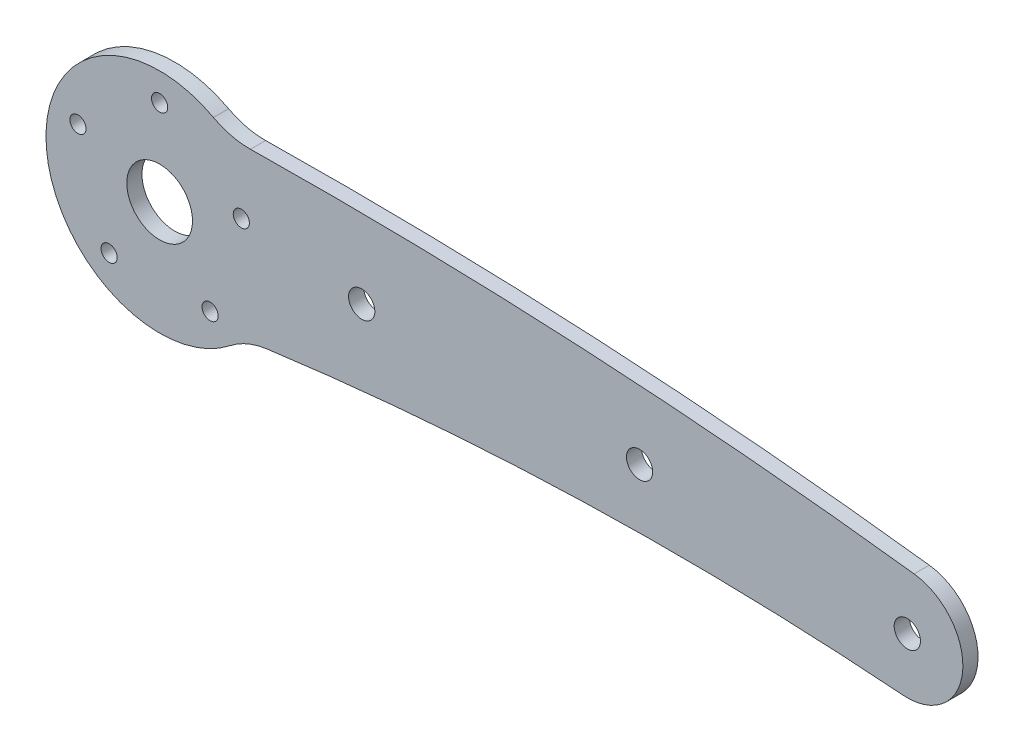
ISO-10303-21;
HEADER;
FILE_DESCRIPTION(('STEP AP214'),'2;1');
FILE_NAME('part.step','',(''),(''),'','','');
FILE_SCHEMA(('AUTOMOTIVE_DESIGN { 1 0 10303 214 1 1 1 1 }'));
ENDSEC;
DATA;
#1=APPLICATION_CONTEXT('core data for automotive mechanical design processes');
#2=APPLICATION_PROTOCOL_DEFINITION('international standard','automotive_design',2000,#1);
#3=PRODUCT_CONTEXT('',#1,'mechanical');
#4=PRODUCT('Part','Part','',(#3));
#5=PRODUCT_RELATED_PRODUCT_CATEGORY('part','',(#4));
#6=PRODUCT_DEFINITION_FORMATION('','',#4);
#7=PRODUCT_DEFINITION_CONTEXT('part definition',#1,'design');
#8=PRODUCT_DEFINITION('design','',#6,#7);
#9=PRODUCT_DEFINITION_SHAPE('','',#8);
#10=(LENGTH_UNIT() NAMED_UNIT(*) SI_UNIT(.MILLI.,.METRE.));
#11=(NAMED_UNIT(*) PLANE_ANGLE_UNIT() SI_UNIT($,.RADIAN.));
#12=(NAMED_UNIT(*) SI_UNIT($,.STERADIAN.) SOLID_ANGLE_UNIT());
#13=UNCERTAINTY_MEASURE_WITH_UNIT(LENGTH_MEASURE(1.E-05),#10,'distance_accuracy_value','');
#14=(GEOMETRIC_REPRESENTATION_CONTEXT(3) GLOBAL_UNCERTAINTY_ASSIGNED_CONTEXT((#13)) GLOBAL_UNIT_ASSIGNED_CONTEXT((#10,
#11,#12)) REPRESENTATION_CONTEXT('',''));
#15=CARTESIAN_POINT('',(0.,0.,0.));
#16=DIRECTION('',(0.,0.,1.));
#17=DIRECTION('',(1.,0.,0.));
#18=AXIS2_PLACEMENT_3D('',#15,#16,#17);
#19=CARTESIAN_POINT('',(16.2151699746623,-465.930427659477,0.));
#20=DIRECTION('',(0.,0.,1.));
#21=DIRECTION('',(1.,0.,0.));
#22=AXIS2_PLACEMENT_3D('',#19,#20,#21);
#23=PLANE('',#22);
#24=CARTESIAN_POINT('',(148.,0.,0.));
#25=DIRECTION('',(0.,0.,1.));
#26=DIRECTION('',(1.,0.,0.));
#27=AXIS2_PLACEMENT_3D('',#24,#25,#26);
#28=CIRCLE('',#27,2.59999999999999);
#29=CARTESIAN_POINT('',(150.6,0.,0.));
#30=VERTEX_POINT('',#29);
#31=EDGE_CURVE('E148',#30,#30,#28,.T.);
#32=ORIENTED_EDGE('',*,*,#31,.T.);
#33=EDGE_LOOP('',(#32));
#34=FACE_BOUND('',#33,.T.);
#35=CARTESIAN_POINT('',(95.,2.5,0.));
#36=DIRECTION('',(0.,0.,1.));
#37=DIRECTION('',(1.,0.,0.));
#38=AXIS2_PLACEMENT_3D('',#35,#36,#37);
#39=CIRCLE('',#38,2.6);
#40=CARTESIAN_POINT('',(97.6,2.5,0.));
#41=VERTEX_POINT('',#40);
#42=EDGE_CURVE('E152',#41,#41,#39,.T.);
#43=ORIENTED_EDGE('',*,*,#42,.T.);
#44=EDGE_LOOP('',(#43));
#45=FACE_BOUND('',#44,.T.);
#46=CARTESIAN_POINT('',(40.,2.5,0.));
#47=DIRECTION('',(0.,0.,1.));
#48=DIRECTION('',(1.,0.,0.));
#49=AXIS2_PLACEMENT_3D('',#46,#47,#48);
#50=CIRCLE('',#49,2.6);
#51=CARTESIAN_POINT('',(42.6,2.5,0.));
#52=VERTEX_POINT('',#51);
#53=EDGE_CURVE('E149',#52,#52,#50,.T.);
#54=ORIENTED_EDGE('',*,*,#53,.T.);
#55=EDGE_LOOP('',(#54));
#56=FACE_BOUND('',#55,.T.);
#57=CARTESIAN_POINT('',(0.,0.,0.));
#58=DIRECTION('',(0.,0.,1.));
#59=DIRECTION('',(1.,0.,0.));
#60=AXIS2_PLACEMENT_3D('',#57,#58,#59);
#61=CIRCLE('',#60,6.5);
#62=CARTESIAN_POINT('',(6.5,0.,0.));
#63=VERTEX_POINT('',#62);
#64=EDGE_CURVE('E138',#63,#63,#61,.T.);
#65=ORIENTED_EDGE('',*,*,#64,.T.);
#66=EDGE_LOOP('',(#65));
#67=FACE_BOUND('',#66,.T.);
#68=CARTESIAN_POINT('',(16.1679607770181,5.25328890437479,0.));
#69=DIRECTION('',(0.,0.,1.));
#70=DIRECTION('',(1.,0.,0.));
#71=AXIS2_PLACEMENT_3D('',#68,#69,#70);
#72=CIRCLE('',#71,1.60000000000033);
#73=CARTESIAN_POINT('',(17.7679607770184,5.25328890437479,0.));
#74=VERTEX_POINT('',#73);
#75=EDGE_CURVE('E133',#74,#74,#72,.T.);
#76=ORIENTED_EDGE('',*,*,#75,.T.);
#77=EDGE_LOOP('',(#76));
#78=FACE_BOUND('',#77,.T.);
#79=CARTESIAN_POINT('',(9.99234928897335,-13.7532889043737,0.));
#80=DIRECTION('',(0.,0.,1.));
#81=DIRECTION('',(1.,0.,0.));
#82=AXIS2_PLACEMENT_3D('',#79,#80,#81);
#83=CIRCLE('',#82,1.60000000000122);
#84=CARTESIAN_POINT('',(11.5923492889746,-13.7532889043737,0.));
#85=VERTEX_POINT('',#84);
#86=EDGE_CURVE('E141',#85,#85,#83,.T.);
#87=ORIENTED_EDGE('',*,*,#86,.T.);
#88=EDGE_LOOP('',(#87));
#89=FACE_BOUND('',#88,.T.);
#90=CARTESIAN_POINT('',(-9.99234928897074,-13.7532889043745,0.));
#91=DIRECTION('',(0.,0.,1.));
#92=DIRECTION('',(1.,0.,0.));
#93=AXIS2_PLACEMENT_3D('',#90,#91,#92);
#94=CIRCLE('',#93,1.60000000000151);
#95=CARTESIAN_POINT('',(-8.39234928896922,-13.7532889043745,0.));
#96=VERTEX_POINT('',#95);
#97=EDGE_CURVE('E137',#96,#96,#94,.T.);
#98=ORIENTED_EDGE('',*,*,#97,.T.);
#99=EDGE_LOOP('',(#98));
#100=FACE_BOUND('',#99,.T.);
#101=CARTESIAN_POINT('',(-16.1679607770171,5.25328890437342,0.));
#102=DIRECTION('',(0.,0.,1.));
#103=DIRECTION('',(1.,0.,0.));
#104=AXIS2_PLACEMENT_3D('',#101,#102,#103);
#105=CIRCLE('',#104,1.60000000000086);
#106=CARTESIAN_POINT('',(-14.5679607770163,5.25328890437342,0.));
#107=VERTEX_POINT('',#106);
#108=EDGE_CURVE('E134',#107,#107,#105,.T.);
#109=ORIENTED_EDGE('',*,*,#108,.T.);
#110=EDGE_LOOP('',(#109));
#111=FACE_BOUND('',#110,.T.);
#112=CARTESIAN_POINT('',(0.,17.,0.));
#113=DIRECTION('',(0.,0.,1.));
#114=DIRECTION('',(1.,0.,0.));
#115=AXIS2_PLACEMENT_3D('',#112,#113,#114);
#116=CIRCLE('',#115,1.6);
#117=CARTESIAN_POINT('',(1.6,17.,0.));
#118=VERTEX_POINT('',#117);
#119=EDGE_CURVE('E130',#118,#118,#116,.T.);
#120=ORIENTED_EDGE('',*,*,#119,.T.);
#121=EDGE_LOOP('',(#120));
#122=FACE_BOUND('',#121,.T.);
#123=CARTESIAN_POINT('',(101.290137246622,-609.211940724704,0.));
#124=DIRECTION('',(0.,0.,-1.));
#125=DIRECTION('',(-1.,0.,0.));
#126=AXIS2_PLACEMENT_3D('',#123,#124,#125);
#127=CIRCLE('',#126,600.);
#128=CARTESIAN_POINT('',(147.159069573998,-10.9678090801501,0.));
#129=VERTEX_POINT('',#128);
#130=CARTESIAN_POINT('',(21.2206318411808,-14.5785458467105,0.));
#131=VERTEX_POINT('',#130);
#132=EDGE_CURVE('E118',#129,#131,#127,.F.);
#133=ORIENTED_EDGE('',*,*,#132,.T.);
#134=CARTESIAN_POINT('',(23.2223694763168,-29.4443807186603,0.));
#135=DIRECTION('',(0.,0.,1.));
#136=DIRECTION('',(1.,0.,0.));
#137=AXIS2_PLACEMENT_3D('',#134,#135,#136);
#138=CIRCLE('',#137,15.);
#139=CARTESIAN_POINT('',(13.9334216857902,-17.6666284311963,0.));
#140=VERTEX_POINT('',#139);
#141=EDGE_CURVE('E11',#131,#140,#138,.T.);
#142=ORIENTED_EDGE('',*,*,#141,.T.);
#143=CARTESIAN_POINT('',(0.,0.,0.));
#144=DIRECTION('',(0.,0.,1.));
#145=DIRECTION('',(1.,0.,0.));
#146=AXIS2_PLACEMENT_3D('',#143,#144,#145);
#147=CIRCLE('',#146,22.5);
#148=CARTESIAN_POINT('',(10.6561368325306,19.8165776007459,0.));
#149=VERTEX_POINT('',#148);
#150=EDGE_CURVE('E119',#149,#140,#147,.T.);
#151=ORIENTED_EDGE('',*,*,#150,.F.);
#152=CARTESIAN_POINT('',(17.7602280542176,33.0276293345766,0.));
#153=DIRECTION('',(0.,0.,1.));
#154=DIRECTION('',(1.,0.,0.));
#155=AXIS2_PLACEMENT_3D('',#152,#153,#154);
#156=CIRCLE('',#155,15.);
#157=CARTESIAN_POINT('',(17.9882608816027,18.0293627337444,0.));
#158=VERTEX_POINT('',#157);
#159=EDGE_CURVE('E46',#149,#158,#156,.T.);
#160=ORIENTED_EDGE('',*,*,#159,.T.);
#161=CARTESIAN_POINT('',(32.4303399493245,-931.860855318953,0.));
#162=DIRECTION('',(0.,0.,-1.));
#163=DIRECTION('',(-1.,0.,0.));
#164=AXIS2_PLACEMENT_3D('',#161,#162,#163);
#165=CIRCLE('',#164,950.);
#166=CARTESIAN_POINT('',(149.353851182702,10.9163678471869,0.));
#167=VERTEX_POINT('',#166);
#168=EDGE_CURVE('E115',#167,#158,#165,.F.);
#169=ORIENTED_EDGE('',*,*,#168,.F.);
#170=CARTESIAN_POINT('',(148.,0.,0.));
#171=DIRECTION('',(0.,0.,-1.));
#172=DIRECTION('',(-1.,0.,0.));
#173=AXIS2_PLACEMENT_3D('',#170,#171,#172);
#174=CIRCLE('',#173,10.9999999999999);
#175=EDGE_CURVE('E121',#129,#167,#174,.F.);
#176=ORIENTED_EDGE('',*,*,#175,.F.);
#177=EDGE_LOOP('',(#133,#142,#151,#160,#169,#176));
#178=FACE_BOUND('',#177,.T.);
#179=ADVANCED_FACE('F37',(#34,#45,#56,#67,#78,#89,#100,#111,#122,#178),#23,.F.);
#180=CARTESIAN_POINT('',(32.4303399493245,-931.860855318953,5.));
#181=DIRECTION('',(0.,0.,-1.));
#182=DIRECTION('',(-1.,0.,0.));
#183=AXIS2_PLACEMENT_3D('',#180,#181,#182);
#184=CYLINDRICAL_SURFACE('',#183,950.);
#185=CARTESIAN_POINT('',(32.4303399493245,-931.860855318953,3.));
#186=DIRECTION('',(0.,0.,-1.));
#187=DIRECTION('',(-1.,0.,0.));
#188=AXIS2_PLACEMENT_3D('',#185,#186,#187);
#189=CIRCLE('',#188,950.);
#190=CARTESIAN_POINT('',(149.353851182702,10.9163678471868,3.));
#191=VERTEX_POINT('',#190);
#192=CARTESIAN_POINT('',(17.9882608816027,18.0293627337445,3.));
#193=VERTEX_POINT('',#192);
#194=EDGE_CURVE('E172',#191,#193,#189,.F.);
#195=ORIENTED_EDGE('',*,*,#194,.F.);
#196=DIRECTION('',(0.,0.,-1.));
#197=VECTOR('',#196,1.);
#198=CARTESIAN_POINT('',(149.353851182702,10.9163678471868,5.));
#199=LINE('',#198,#197);
#200=EDGE_CURVE('E124',#167,#191,#199,.F.);
#201=ORIENTED_EDGE('',*,*,#200,.F.);
#202=ORIENTED_EDGE('',*,*,#168,.T.);
#203=DIRECTION('',(0.,0.,-1.));
#204=VECTOR('',#203,1.);
#205=CARTESIAN_POINT('',(17.9882608816027,18.0293627337446,5.));
#206=LINE('',#205,#204);
#207=EDGE_CURVE('E105',#158,#193,#206,.F.);
#208=ORIENTED_EDGE('',*,*,#207,.T.);
#209=EDGE_LOOP('',(#195,#201,#202,#208));
#210=FACE_BOUND('',#209,.T.);
#211=ADVANCED_FACE('F210',(#210),#184,.T.);
#212=CARTESIAN_POINT('',(101.290137246622,-609.211940724704,5.));
#213=DIRECTION('',(0.,0.,-1.));
#214=DIRECTION('',(-1.,0.,0.));
#215=AXIS2_PLACEMENT_3D('',#212,#213,#214);
#216=CYLINDRICAL_SURFACE('',#215,600.);
#217=DIRECTION('',(0.,0.,-1.));
#218=VECTOR('',#217,1.);
#219=CARTESIAN_POINT('',(147.159069573998,-10.9678090801501,5.));
#220=LINE('',#219,#218);
#221=CARTESIAN_POINT('',(147.159069573998,-10.9678090801502,3.));
#222=VERTEX_POINT('',#221);
#223=EDGE_CURVE('E101',#222,#129,#220,.T.);
#224=ORIENTED_EDGE('',*,*,#223,.F.);
#225=CARTESIAN_POINT('',(101.290137246622,-609.211940724704,3.));
#226=DIRECTION('',(0.,0.,-1.));
#227=DIRECTION('',(-1.,0.,0.));
#228=AXIS2_PLACEMENT_3D('',#225,#226,#227);
#229=CIRCLE('',#228,600.);
#230=CARTESIAN_POINT('',(21.2206318411808,-14.5785458467105,3.));
#231=VERTEX_POINT('',#230);
#232=EDGE_CURVE('E92',#222,#231,#229,.F.);
#233=ORIENTED_EDGE('',*,*,#232,.T.);
#234=DIRECTION('',(0.,0.,-1.));
#235=VECTOR('',#234,1.);
#236=CARTESIAN_POINT('',(21.2206318411808,-14.5785458467105,5.));
#237=LINE('',#236,#235);
#238=EDGE_CURVE('E61',#231,#131,#237,.T.);
#239=ORIENTED_EDGE('',*,*,#238,.T.);
#240=ORIENTED_EDGE('',*,*,#132,.F.);
#241=EDGE_LOOP('',(#224,#233,#239,#240));
#242=FACE_BOUND('',#241,.T.);
#243=ADVANCED_FACE('F100',(#242),#216,.F.);
#244=CARTESIAN_POINT('',(148.,0.,5.));
#245=DIRECTION('',(0.,0.,-1.));
#246=DIRECTION('',(-1.,0.,0.));
#247=AXIS2_PLACEMENT_3D('',#244,#245,#246);
#248=CYLINDRICAL_SURFACE('',#247,10.9999999999999);
#249=CARTESIAN_POINT('',(148.,0.,3.));
#250=DIRECTION('',(0.,0.,-1.));
#251=DIRECTION('',(-1.,0.,0.));
#252=AXIS2_PLACEMENT_3D('',#249,#250,#251);
#253=CIRCLE('',#252,10.9999999999999);
#254=EDGE_CURVE('E174',#222,#191,#253,.F.);
#255=ORIENTED_EDGE('',*,*,#254,.F.);
#256=ORIENTED_EDGE('',*,*,#223,.T.);
#257=ORIENTED_EDGE('',*,*,#175,.T.);
#258=ORIENTED_EDGE('',*,*,#200,.T.);
#259=EDGE_LOOP('',(#255,#256,#257,#258));
#260=FACE_BOUND('',#259,.T.);
#261=ADVANCED_FACE('F230',(#260),#248,.T.);
#262=CARTESIAN_POINT('',(0.,0.,0.));
#263=DIRECTION('',(0.,0.,1.));
#264=DIRECTION('',(1.,0.,0.));
#265=AXIS2_PLACEMENT_3D('',#262,#263,#264);
#266=CYLINDRICAL_SURFACE('',#265,22.5);
#267=CARTESIAN_POINT('',(0.,0.,3.));
#268=DIRECTION('',(0.,0.,-1.));
#269=DIRECTION('',(-1.,0.,0.));
#270=AXIS2_PLACEMENT_3D('',#267,#268,#269);
#271=CIRCLE('',#270,22.5);
#272=CARTESIAN_POINT('',(10.6561368325306,19.8165776007459,3.));
#273=VERTEX_POINT('',#272);
#274=CARTESIAN_POINT('',(13.9334216857902,-17.6666284311963,3.));
#275=VERTEX_POINT('',#274);
#276=EDGE_CURVE('E53',#273,#275,#271,.F.);
#277=ORIENTED_EDGE('',*,*,#276,.F.);
#278=DIRECTION('',(0.,0.,1.));
#279=VECTOR('',#278,1.);
#280=CARTESIAN_POINT('',(10.6561368325306,19.8165776007459,0.));
#281=LINE('',#280,#279);
#282=EDGE_CURVE('E109',#273,#149,#281,.F.);
#283=ORIENTED_EDGE('',*,*,#282,.T.);
#284=ORIENTED_EDGE('',*,*,#150,.T.);
#285=DIRECTION('',(0.,0.,1.));
#286=VECTOR('',#285,1.);
#287=CARTESIAN_POINT('',(13.9334216857902,-17.6666284311963,0.));
#288=LINE('',#287,#286);
#289=EDGE_CURVE('E113',#140,#275,#288,.T.);
#290=ORIENTED_EDGE('',*,*,#289,.T.);
#291=EDGE_LOOP('',(#277,#283,#284,#290));
#292=FACE_BOUND('',#291,.T.);
#293=ADVANCED_FACE('F213',(#292),#266,.T.);
#294=CARTESIAN_POINT('',(0.,17.,0.));
#295=DIRECTION('',(0.,0.,1.));
#296=DIRECTION('',(1.,0.,0.));
#297=AXIS2_PLACEMENT_3D('',#294,#295,#296);
#298=CYLINDRICAL_SURFACE('',#297,1.6);
#299=CARTESIAN_POINT('',(0.,17.,3.));
#300=DIRECTION('',(0.,0.,-1.));
#301=DIRECTION('',(-1.,0.,0.));
#302=AXIS2_PLACEMENT_3D('',#299,#300,#301);
#303=CIRCLE('',#302,1.6);
#304=CARTESIAN_POINT('',(-1.6,17.,3.));
#305=VERTEX_POINT('',#304);
#306=EDGE_CURVE('E153',#305,#305,#303,.F.);
#307=ORIENTED_EDGE('',*,*,#306,.T.);
#308=EDGE_LOOP('',(#307));
#309=FACE_BOUND('',#308,.T.);
#310=ORIENTED_EDGE('',*,*,#119,.F.);
#311=EDGE_LOOP('',(#310));
#312=FACE_BOUND('',#311,.T.);
#313=ADVANCED_FACE('F240',(#309,#312),#298,.F.);
#314=CARTESIAN_POINT('',(-16.1679607770171,5.25328890437342,0.));
#315=DIRECTION('',(0.,0.,1.));
#316=DIRECTION('',(1.,0.,0.));
#317=AXIS2_PLACEMENT_3D('',#314,#315,#316);
#318=CYLINDRICAL_SURFACE('',#317,1.60000000000086);
#319=CARTESIAN_POINT('',(-16.1679607770171,5.25328890437342,3.));
#320=DIRECTION('',(0.,0.,-1.));
#321=DIRECTION('',(-1.,0.,0.));
#322=AXIS2_PLACEMENT_3D('',#319,#320,#321);
#323=CIRCLE('',#322,1.60000000000086);
#324=CARTESIAN_POINT('',(-17.767960777018,5.25328890437342,3.));
#325=VERTEX_POINT('',#324);
#326=EDGE_CURVE('E160',#325,#325,#323,.F.);
#327=ORIENTED_EDGE('',*,*,#326,.T.);
#328=EDGE_LOOP('',(#327));
#329=FACE_BOUND('',#328,.T.);
#330=ORIENTED_EDGE('',*,*,#108,.F.);
#331=EDGE_LOOP('',(#330));
#332=FACE_BOUND('',#331,.T.);
#333=ADVANCED_FACE('F246',(#329,#332),#318,.F.);
#334=CARTESIAN_POINT('',(-9.99234928897074,-13.7532889043745,0.));
#335=DIRECTION('',(0.,0.,1.));
#336=DIRECTION('',(1.,0.,0.));
#337=AXIS2_PLACEMENT_3D('',#334,#335,#336);
#338=CYLINDRICAL_SURFACE('',#337,1.60000000000151);
#339=CARTESIAN_POINT('',(-9.99234928897074,-13.7532889043745,3.));
#340=DIRECTION('',(0.,0.,-1.));
#341=DIRECTION('',(-1.,0.,0.));
#342=AXIS2_PLACEMENT_3D('',#339,#340,#341);
#343=CIRCLE('',#342,1.60000000000151);
#344=CARTESIAN_POINT('',(-11.5923492889723,-13.7532889043745,3.));
#345=VERTEX_POINT('',#344);
#346=EDGE_CURVE('E163',#345,#345,#343,.F.);
#347=ORIENTED_EDGE('',*,*,#346,.T.);
#348=EDGE_LOOP('',(#347));
#349=FACE_BOUND('',#348,.T.);
#350=ORIENTED_EDGE('',*,*,#97,.F.);
#351=EDGE_LOOP('',(#350));
#352=FACE_BOUND('',#351,.T.);
#353=ADVANCED_FACE('F267',(#349,#352),#338,.F.);
#354=CARTESIAN_POINT('',(9.99234928897335,-13.7532889043737,0.));
#355=DIRECTION('',(0.,0.,1.));
#356=DIRECTION('',(1.,0.,0.));
#357=AXIS2_PLACEMENT_3D('',#354,#355,#356);
#358=CYLINDRICAL_SURFACE('',#357,1.60000000000122);
#359=CARTESIAN_POINT('',(9.99234928897335,-13.7532889043737,3.));
#360=DIRECTION('',(0.,0.,-1.));
#361=DIRECTION('',(-1.,0.,0.));
#362=AXIS2_PLACEMENT_3D('',#359,#360,#361);
#363=CIRCLE('',#362,1.60000000000122);
#364=CARTESIAN_POINT('',(8.39234928897213,-13.7532889043737,3.));
#365=VERTEX_POINT('',#364);
#366=EDGE_CURVE('E166',#365,#365,#363,.F.);
#367=ORIENTED_EDGE('',*,*,#366,.T.);
#368=EDGE_LOOP('',(#367));
#369=FACE_BOUND('',#368,.T.);
#370=ORIENTED_EDGE('',*,*,#86,.F.);
#371=EDGE_LOOP('',(#370));
#372=FACE_BOUND('',#371,.T.);
#373=ADVANCED_FACE('F261',(#369,#372),#358,.F.);
#374=CARTESIAN_POINT('',(16.1679607770181,5.25328890437479,0.));
#375=DIRECTION('',(0.,0.,1.));
#376=DIRECTION('',(1.,0.,0.));
#377=AXIS2_PLACEMENT_3D('',#374,#375,#376);
#378=CYLINDRICAL_SURFACE('',#377,1.60000000000033);
#379=CARTESIAN_POINT('',(16.1679607770181,5.25328890437479,3.));
#380=DIRECTION('',(0.,0.,-1.));
#381=DIRECTION('',(-1.,0.,0.));
#382=AXIS2_PLACEMENT_3D('',#379,#380,#381);
#383=CIRCLE('',#382,1.60000000000033);
#384=CARTESIAN_POINT('',(14.5679607770178,5.25328890437479,3.));
#385=VERTEX_POINT('',#384);
#386=EDGE_CURVE('E169',#385,#385,#383,.F.);
#387=ORIENTED_EDGE('',*,*,#386,.T.);
#388=EDGE_LOOP('',(#387));
#389=FACE_BOUND('',#388,.T.);
#390=ORIENTED_EDGE('',*,*,#75,.F.);
#391=EDGE_LOOP('',(#390));
#392=FACE_BOUND('',#391,.T.);
#393=ADVANCED_FACE('F256',(#389,#392),#378,.F.);
#394=CARTESIAN_POINT('',(17.7602280542176,33.0276293345766,5.));
#395=DIRECTION('',(0.,0.,1.));
#396=DIRECTION('',(1.,0.,0.));
#397=AXIS2_PLACEMENT_3D('',#394,#395,#396);
#398=CYLINDRICAL_SURFACE('',#397,15.);
#399=ORIENTED_EDGE('',*,*,#282,.F.);
#400=CARTESIAN_POINT('',(17.7602280542176,33.0276293345766,3.));
#401=DIRECTION('',(0.,0.,-1.));
#402=DIRECTION('',(-1.,0.,0.));
#403=AXIS2_PLACEMENT_3D('',#400,#401,#402);
#404=CIRCLE('',#403,15.);
#405=EDGE_CURVE('E102',#273,#193,#404,.F.);
#406=ORIENTED_EDGE('',*,*,#405,.T.);
#407=ORIENTED_EDGE('',*,*,#207,.F.);
#408=ORIENTED_EDGE('',*,*,#159,.F.);
#409=EDGE_LOOP('',(#399,#406,#407,#408));
#410=FACE_BOUND('',#409,.T.);
#411=ADVANCED_FACE('F237',(#410),#398,.F.);
#412=CARTESIAN_POINT('',(23.2223694763168,-29.4443807186603,0.));
#413=DIRECTION('',(0.,0.,-1.));
#414=DIRECTION('',(-1.,0.,0.));
#415=AXIS2_PLACEMENT_3D('',#412,#413,#414);
#416=CYLINDRICAL_SURFACE('',#415,15.);
#417=ORIENTED_EDGE('',*,*,#238,.F.);
#418=CARTESIAN_POINT('',(23.2223694763168,-29.4443807186603,3.));
#419=DIRECTION('',(0.,0.,-1.));
#420=DIRECTION('',(-1.,0.,0.));
#421=AXIS2_PLACEMENT_3D('',#418,#419,#420);
#422=CIRCLE('',#421,15.);
#423=EDGE_CURVE('E89',#231,#275,#422,.F.);
#424=ORIENTED_EDGE('',*,*,#423,.T.);
#425=ORIENTED_EDGE('',*,*,#289,.F.);
#426=ORIENTED_EDGE('',*,*,#141,.F.);
#427=EDGE_LOOP('',(#417,#424,#425,#426));
#428=FACE_BOUND('',#427,.T.);
#429=ADVANCED_FACE('F39',(#428),#416,.F.);
#430=CARTESIAN_POINT('',(0.,0.,0.));
#431=DIRECTION('',(0.,0.,1.));
#432=DIRECTION('',(1.,0.,0.));
#433=AXIS2_PLACEMENT_3D('',#430,#431,#432);
#434=CYLINDRICAL_SURFACE('',#433,6.5);
#435=CARTESIAN_POINT('',(0.,0.,3.));
#436=DIRECTION('',(0.,0.,-1.));
#437=DIRECTION('',(-1.,0.,0.));
#438=AXIS2_PLACEMENT_3D('',#435,#436,#437);
#439=CIRCLE('',#438,6.5);
#440=CARTESIAN_POINT('',(-6.5,0.,3.));
#441=VERTEX_POINT('',#440);
#442=EDGE_CURVE('E97',#441,#441,#439,.F.);
#443=ORIENTED_EDGE('',*,*,#442,.T.);
#444=EDGE_LOOP('',(#443));
#445=FACE_BOUND('',#444,.T.);
#446=ORIENTED_EDGE('',*,*,#64,.F.);
#447=EDGE_LOOP('',(#446));
#448=FACE_BOUND('',#447,.T.);
#449=ADVANCED_FACE('F204',(#445,#448),#434,.F.);
#450=CARTESIAN_POINT('',(40.,2.5,0.));
#451=DIRECTION('',(0.,0.,1.));
#452=DIRECTION('',(1.,0.,0.));
#453=AXIS2_PLACEMENT_3D('',#450,#451,#452);
#454=CYLINDRICAL_SURFACE('',#453,2.6);
#455=CARTESIAN_POINT('',(40.,2.5,3.));
#456=DIRECTION('',(0.,0.,-1.));
#457=DIRECTION('',(-1.,0.,0.));
#458=AXIS2_PLACEMENT_3D('',#455,#456,#457);
#459=CIRCLE('',#458,2.6);
#460=CARTESIAN_POINT('',(37.4,2.5,3.));
#461=VERTEX_POINT('',#460);
#462=EDGE_CURVE('E181',#461,#461,#459,.F.);
#463=ORIENTED_EDGE('',*,*,#462,.T.);
#464=EDGE_LOOP('',(#463));
#465=FACE_BOUND('',#464,.T.);
#466=ORIENTED_EDGE('',*,*,#53,.F.);
#467=EDGE_LOOP('',(#466));
#468=FACE_BOUND('',#467,.T.);
#469=ADVANCED_FACE('F200',(#465,#468),#454,.F.);
#470=CARTESIAN_POINT('',(95.,2.5,0.));
#471=DIRECTION('',(0.,0.,1.));
#472=DIRECTION('',(1.,0.,0.));
#473=AXIS2_PLACEMENT_3D('',#470,#471,#472);
#474=CYLINDRICAL_SURFACE('',#473,2.6);
#475=CARTESIAN_POINT('',(95.,2.5,3.));
#476=DIRECTION('',(0.,0.,-1.));
#477=DIRECTION('',(-1.,0.,0.));
#478=AXIS2_PLACEMENT_3D('',#475,#476,#477);
#479=CIRCLE('',#478,2.6);
#480=CARTESIAN_POINT('',(92.4,2.5,3.));
#481=VERTEX_POINT('',#480);
#482=EDGE_CURVE('E184',#481,#481,#479,.F.);
#483=ORIENTED_EDGE('',*,*,#482,.T.);
#484=EDGE_LOOP('',(#483));
#485=FACE_BOUND('',#484,.T.);
#486=ORIENTED_EDGE('',*,*,#42,.F.);
#487=EDGE_LOOP('',(#486));
#488=FACE_BOUND('',#487,.T.);
#489=ADVANCED_FACE('F203',(#485,#488),#474,.F.);
#490=CARTESIAN_POINT('',(148.,0.,0.));
#491=DIRECTION('',(0.,0.,1.));
#492=DIRECTION('',(1.,0.,0.));
#493=AXIS2_PLACEMENT_3D('',#490,#491,#492);
#494=CYLINDRICAL_SURFACE('',#493,2.59999999999999);
#495=CARTESIAN_POINT('',(148.,0.,3.));
#496=DIRECTION('',(0.,0.,-1.));
#497=DIRECTION('',(-1.,0.,0.));
#498=AXIS2_PLACEMENT_3D('',#495,#496,#497);
#499=CIRCLE('',#498,2.59999999999999);
#500=CARTESIAN_POINT('',(145.4,0.,3.));
#501=VERTEX_POINT('',#500);
#502=EDGE_CURVE('E41',#501,#501,#499,.F.);
#503=ORIENTED_EDGE('',*,*,#502,.T.);
#504=EDGE_LOOP('',(#503));
#505=FACE_BOUND('',#504,.T.);
#506=ORIENTED_EDGE('',*,*,#31,.F.);
#507=EDGE_LOOP('',(#506));
#508=FACE_BOUND('',#507,.T.);
#509=ADVANCED_FACE('F191',(#505,#508),#494,.F.);
#510=CARTESIAN_POINT('',(0.,0.,3.));
#511=DIRECTION('',(0.,0.,-1.));
#512=DIRECTION('',(-1.,0.,0.));
#513=AXIS2_PLACEMENT_3D('',#510,#511,#512);
#514=PLANE('',#513);
#515=ORIENTED_EDGE('',*,*,#326,.F.);
#516=EDGE_LOOP('',(#515));
#517=FACE_BOUND('',#516,.T.);
#518=ORIENTED_EDGE('',*,*,#366,.F.);
#519=EDGE_LOOP('',(#518));
#520=FACE_BOUND('',#519,.T.);
#521=ORIENTED_EDGE('',*,*,#442,.F.);
#522=EDGE_LOOP('',(#521));
#523=FACE_BOUND('',#522,.T.);
#524=ORIENTED_EDGE('',*,*,#482,.F.);
#525=EDGE_LOOP('',(#524));
#526=FACE_BOUND('',#525,.T.);
#527=ORIENTED_EDGE('',*,*,#502,.F.);
#528=EDGE_LOOP('',(#527));
#529=FACE_BOUND('',#528,.T.);
#530=ORIENTED_EDGE('',*,*,#462,.F.);
#531=EDGE_LOOP('',(#530));
#532=FACE_BOUND('',#531,.T.);
#533=ORIENTED_EDGE('',*,*,#194,.T.);
#534=ORIENTED_EDGE('',*,*,#405,.F.);
#535=ORIENTED_EDGE('',*,*,#276,.T.);
#536=ORIENTED_EDGE('',*,*,#423,.F.);
#537=ORIENTED_EDGE('',*,*,#232,.F.);
#538=ORIENTED_EDGE('',*,*,#254,.T.);
#539=EDGE_LOOP('',(#533,#534,#535,#536,#537,#538));
#540=FACE_BOUND('',#539,.T.);
#541=ORIENTED_EDGE('',*,*,#386,.F.);
#542=EDGE_LOOP('',(#541));
#543=FACE_BOUND('',#542,.T.);
#544=ORIENTED_EDGE('',*,*,#346,.F.);
#545=EDGE_LOOP('',(#544));
#546=FACE_BOUND('',#545,.T.);
#547=ORIENTED_EDGE('',*,*,#306,.F.);
#548=EDGE_LOOP('',(#547));
#549=FACE_BOUND('',#548,.T.);
#550=ADVANCED_FACE('F90',(#517,#520,#523,#526,#529,#532,#540,#543,#546,#549),#514,.F.);
#551=CLOSED_SHELL('',(#179,#211,#243,#261,#293,#313,#333,#353,#373,#393,#411,#429,#449,#469,
#489,#509,#550));
#552=MANIFOLD_SOLID_BREP('B2',#551);
#553=ADVANCED_BREP_SHAPE_REPRESENTATION('',(#18,#552),#14);
#554=SHAPE_DEFINITION_REPRESENTATION(#9,#553);
ENDSEC;
END-ISO-10303-21;
